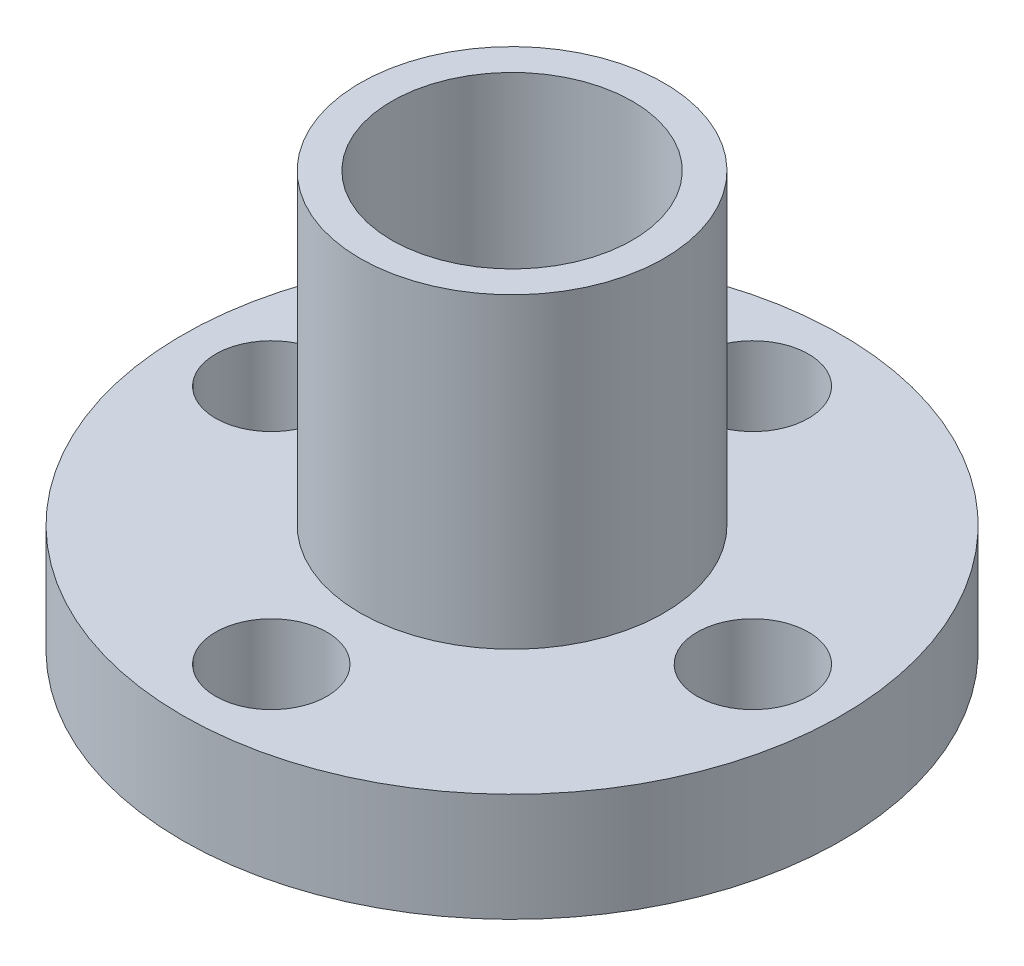
ISO-10303-21;
HEADER;
FILE_DESCRIPTION(('STEP AP214'),'2;1');
FILE_NAME('part.step','',(''),(''),'','','');
FILE_SCHEMA(('AUTOMOTIVE_DESIGN { 1 0 10303 214 1 1 1 1 }'));
ENDSEC;
DATA;
#1=APPLICATION_CONTEXT('core data for automotive mechanical design processes');
#2=APPLICATION_PROTOCOL_DEFINITION('international standard','automotive_design',2000,#1);
#3=PRODUCT_CONTEXT('',#1,'mechanical');
#4=PRODUCT('Part','Part','',(#3));
#5=PRODUCT_RELATED_PRODUCT_CATEGORY('part','',(#4));
#6=PRODUCT_DEFINITION_FORMATION('','',#4);
#7=PRODUCT_DEFINITION_CONTEXT('part definition',#1,'design');
#8=PRODUCT_DEFINITION('design','',#6,#7);
#9=PRODUCT_DEFINITION_SHAPE('','',#8);
#10=(LENGTH_UNIT() NAMED_UNIT(*) SI_UNIT(.MILLI.,.METRE.));
#11=(NAMED_UNIT(*) PLANE_ANGLE_UNIT() SI_UNIT($,.RADIAN.));
#12=(NAMED_UNIT(*) SI_UNIT($,.STERADIAN.) SOLID_ANGLE_UNIT());
#13=UNCERTAINTY_MEASURE_WITH_UNIT(LENGTH_MEASURE(1.E-05),#10,'distance_accuracy_value','');
#14=(GEOMETRIC_REPRESENTATION_CONTEXT(3) GLOBAL_UNCERTAINTY_ASSIGNED_CONTEXT((#13)) GLOBAL_UNIT_ASSIGNED_CONTEXT((#10,
#11,#12)) REPRESENTATION_CONTEXT('',''));
#15=CARTESIAN_POINT('',(0.,0.,0.));
#16=DIRECTION('',(0.,0.,1.));
#17=DIRECTION('',(1.,0.,0.));
#18=AXIS2_PLACEMENT_3D('',#15,#16,#17);
#19=CARTESIAN_POINT('',(0.,3.6,0.));
#20=DIRECTION('',(0.,-1.,0.));
#21=DIRECTION('',(0.,0.,-1.));
#22=AXIS2_PLACEMENT_3D('',#19,#20,#21);
#23=CYLINDRICAL_SURFACE('',#22,10.95);
#24=CARTESIAN_POINT('',(0.,3.6,0.));
#25=DIRECTION('',(0.,1.,0.));
#26=DIRECTION('',(0.,0.,1.));
#27=AXIS2_PLACEMENT_3D('',#24,#25,#26);
#28=CIRCLE('',#27,10.95);
#29=CARTESIAN_POINT('',(0.,3.6,10.95));
#30=VERTEX_POINT('',#29);
#31=EDGE_CURVE('E40',#30,#30,#28,.T.);
#32=ORIENTED_EDGE('',*,*,#31,.F.);
#33=EDGE_LOOP('',(#32));
#34=FACE_BOUND('',#33,.T.);
#35=CARTESIAN_POINT('',(0.,0.,0.));
#36=DIRECTION('',(0.,1.,0.));
#37=DIRECTION('',(0.,0.,1.));
#38=AXIS2_PLACEMENT_3D('',#35,#36,#37);
#39=CIRCLE('',#38,10.95);
#40=CARTESIAN_POINT('',(0.,0.,10.95));
#41=VERTEX_POINT('',#40);
#42=EDGE_CURVE('E45',#41,#41,#39,.T.);
#43=ORIENTED_EDGE('',*,*,#42,.T.);
#44=EDGE_LOOP('',(#43));
#45=FACE_BOUND('',#44,.T.);
#46=ADVANCED_FACE('F33',(#34,#45),#23,.T.);
#47=CARTESIAN_POINT('',(0.,3.6,0.));
#48=DIRECTION('',(0.,1.,0.));
#49=DIRECTION('',(0.,0.,1.));
#50=AXIS2_PLACEMENT_3D('',#47,#48,#49);
#51=PLANE('',#50);
#52=CARTESIAN_POINT('',(-7.99999999999977,3.6,2.27373675443232E-13));
#53=DIRECTION('',(0.,1.,0.));
#54=DIRECTION('',(0.,0.,1.));
#55=AXIS2_PLACEMENT_3D('',#52,#53,#54);
#56=CIRCLE('',#55,1.85000000000036);
#57=CARTESIAN_POINT('',(-7.99999999999977,3.6,1.85000000000059));
#58=VERTEX_POINT('',#57);
#59=EDGE_CURVE('E59',#58,#58,#56,.T.);
#60=ORIENTED_EDGE('',*,*,#59,.F.);
#61=EDGE_LOOP('',(#60));
#62=FACE_BOUND('',#61,.T.);
#63=CARTESIAN_POINT('',(4.52787916007828E-13,3.6,8.));
#64=DIRECTION('',(0.,1.,0.));
#65=DIRECTION('',(0.,0.,1.));
#66=AXIS2_PLACEMENT_3D('',#63,#64,#65);
#67=CIRCLE('',#66,1.85000000000049);
#68=CARTESIAN_POINT('',(4.52787916007828E-13,3.6,9.85000000000048));
#69=VERTEX_POINT('',#68);
#70=EDGE_CURVE('E56',#69,#69,#67,.T.);
#71=ORIENTED_EDGE('',*,*,#70,.F.);
#72=EDGE_LOOP('',(#71));
#73=FACE_BOUND('',#72,.T.);
#74=CARTESIAN_POINT('',(8.00000000000022,3.6,-2.26393958003914E-13));
#75=DIRECTION('',(0.,1.,0.));
#76=DIRECTION('',(0.,0.,1.));
#77=AXIS2_PLACEMENT_3D('',#74,#75,#76);
#78=CIRCLE('',#77,1.85000000000018);
#79=CARTESIAN_POINT('',(8.00000000000022,3.6,1.84999999999995));
#80=VERTEX_POINT('',#79);
#81=EDGE_CURVE('E53',#80,#80,#78,.T.);
#82=ORIENTED_EDGE('',*,*,#81,.F.);
#83=EDGE_LOOP('',(#82));
#84=FACE_BOUND('',#83,.T.);
#85=CARTESIAN_POINT('',(0.,3.6,-8.));
#86=DIRECTION('',(0.,1.,0.));
#87=DIRECTION('',(0.,0.,1.));
#88=AXIS2_PLACEMENT_3D('',#85,#86,#87);
#89=CIRCLE('',#88,1.85);
#90=CARTESIAN_POINT('',(0.,3.6,-6.15));
#91=VERTEX_POINT('',#90);
#92=EDGE_CURVE('E52',#91,#91,#89,.T.);
#93=ORIENTED_EDGE('',*,*,#92,.F.);
#94=EDGE_LOOP('',(#93));
#95=FACE_BOUND('',#94,.T.);
#96=CARTESIAN_POINT('',(0.,3.6,0.));
#97=DIRECTION('',(0.,1.,0.));
#98=DIRECTION('',(0.,0.,1.));
#99=AXIS2_PLACEMENT_3D('',#96,#97,#98);
#100=CIRCLE('',#99,5.05);
#101=CARTESIAN_POINT('',(0.,3.6,5.05));
#102=VERTEX_POINT('',#101);
#103=EDGE_CURVE('E83',#102,#102,#100,.T.);
#104=ORIENTED_EDGE('',*,*,#103,.F.);
#105=EDGE_LOOP('',(#104));
#106=FACE_BOUND('',#105,.T.);
#107=ORIENTED_EDGE('',*,*,#31,.T.);
#108=EDGE_LOOP('',(#107));
#109=FACE_BOUND('',#108,.T.);
#110=ADVANCED_FACE('F92',(#62,#73,#84,#95,#106,#109),#51,.T.);
#111=CARTESIAN_POINT('',(0.,0.,0.));
#112=DIRECTION('',(0.,1.,0.));
#113=DIRECTION('',(0.,0.,1.));
#114=AXIS2_PLACEMENT_3D('',#111,#112,#113);
#115=PLANE('',#114);
#116=CARTESIAN_POINT('',(-7.99999999999977,0.,2.27373675443232E-13));
#117=DIRECTION('',(0.,1.,0.));
#118=DIRECTION('',(0.,0.,1.));
#119=AXIS2_PLACEMENT_3D('',#116,#117,#118);
#120=CIRCLE('',#119,1.85000000000036);
#121=CARTESIAN_POINT('',(-7.99999999999977,0.,1.85000000000059));
#122=VERTEX_POINT('',#121);
#123=EDGE_CURVE('E36',#122,#122,#120,.T.);
#124=ORIENTED_EDGE('',*,*,#123,.T.);
#125=EDGE_LOOP('',(#124));
#126=FACE_BOUND('',#125,.T.);
#127=CARTESIAN_POINT('',(4.52787916007828E-13,0.,8.));
#128=DIRECTION('',(0.,1.,0.));
#129=DIRECTION('',(0.,0.,1.));
#130=AXIS2_PLACEMENT_3D('',#127,#128,#129);
#131=CIRCLE('',#130,1.85000000000049);
#132=CARTESIAN_POINT('',(4.52787916007828E-13,0.,9.85000000000048));
#133=VERTEX_POINT('',#132);
#134=EDGE_CURVE('E57',#133,#133,#131,.T.);
#135=ORIENTED_EDGE('',*,*,#134,.T.);
#136=EDGE_LOOP('',(#135));
#137=FACE_BOUND('',#136,.T.);
#138=CARTESIAN_POINT('',(8.00000000000022,0.,-2.26393958003914E-13));
#139=DIRECTION('',(0.,1.,0.));
#140=DIRECTION('',(0.,0.,1.));
#141=AXIS2_PLACEMENT_3D('',#138,#139,#140);
#142=CIRCLE('',#141,1.85000000000018);
#143=CARTESIAN_POINT('',(8.00000000000022,0.,1.84999999999995));
#144=VERTEX_POINT('',#143);
#145=EDGE_CURVE('E54',#144,#144,#142,.T.);
#146=ORIENTED_EDGE('',*,*,#145,.T.);
#147=EDGE_LOOP('',(#146));
#148=FACE_BOUND('',#147,.T.);
#149=CARTESIAN_POINT('',(0.,0.,-8.));
#150=DIRECTION('',(0.,1.,0.));
#151=DIRECTION('',(0.,0.,1.));
#152=AXIS2_PLACEMENT_3D('',#149,#150,#151);
#153=CIRCLE('',#152,1.85);
#154=CARTESIAN_POINT('',(0.,0.,-6.15));
#155=VERTEX_POINT('',#154);
#156=EDGE_CURVE('E49',#155,#155,#153,.T.);
#157=ORIENTED_EDGE('',*,*,#156,.T.);
#158=EDGE_LOOP('',(#157));
#159=FACE_BOUND('',#158,.T.);
#160=CARTESIAN_POINT('',(0.,0.,0.));
#161=DIRECTION('',(0.,1.,0.));
#162=DIRECTION('',(0.,0.,1.));
#163=AXIS2_PLACEMENT_3D('',#160,#161,#162);
#164=CIRCLE('',#163,5.05);
#165=CARTESIAN_POINT('',(0.,0.,5.05));
#166=VERTEX_POINT('',#165);
#167=EDGE_CURVE('E10',#166,#166,#164,.F.);
#168=ORIENTED_EDGE('',*,*,#167,.F.);
#169=EDGE_LOOP('',(#168));
#170=FACE_BOUND('',#169,.T.);
#171=ORIENTED_EDGE('',*,*,#42,.F.);
#172=EDGE_LOOP('',(#171));
#173=FACE_BOUND('',#172,.T.);
#174=ADVANCED_FACE('F95',(#126,#137,#148,#159,#170,#173),#115,.F.);
#175=CARTESIAN_POINT('',(0.,13.8,0.));
#176=DIRECTION('',(0.,1.,0.));
#177=DIRECTION('',(0.,0.,1.));
#178=AXIS2_PLACEMENT_3D('',#175,#176,#177);
#179=PLANE('',#178);
#180=CARTESIAN_POINT('',(0.,13.8,0.));
#181=DIRECTION('',(0.,1.,0.));
#182=DIRECTION('',(0.,0.,1.));
#183=AXIS2_PLACEMENT_3D('',#180,#181,#182);
#184=CIRCLE('',#183,5.05);
#185=CARTESIAN_POINT('',(0.,13.8,5.05));
#186=VERTEX_POINT('',#185);
#187=EDGE_CURVE('E84',#186,#186,#184,.T.);
#188=ORIENTED_EDGE('',*,*,#187,.T.);
#189=EDGE_LOOP('',(#188));
#190=FACE_BOUND('',#189,.T.);
#191=CARTESIAN_POINT('',(0.,13.8,0.));
#192=DIRECTION('',(0.,1.,0.));
#193=DIRECTION('',(0.,0.,1.));
#194=AXIS2_PLACEMENT_3D('',#191,#192,#193);
#195=CIRCLE('',#194,4.);
#196=CARTESIAN_POINT('',(0.,13.8,4.));
#197=VERTEX_POINT('',#196);
#198=EDGE_CURVE('E80',#197,#197,#195,.T.);
#199=ORIENTED_EDGE('',*,*,#198,.F.);
#200=EDGE_LOOP('',(#199));
#201=FACE_BOUND('',#200,.T.);
#202=ADVANCED_FACE('F106',(#190,#201),#179,.T.);
#203=CARTESIAN_POINT('',(0.,13.8,0.));
#204=DIRECTION('',(0.,-1.,0.));
#205=DIRECTION('',(0.,0.,-1.));
#206=AXIS2_PLACEMENT_3D('',#203,#204,#205);
#207=CYLINDRICAL_SURFACE('',#206,5.05);
#208=ORIENTED_EDGE('',*,*,#187,.F.);
#209=EDGE_LOOP('',(#208));
#210=FACE_BOUND('',#209,.T.);
#211=ORIENTED_EDGE('',*,*,#103,.T.);
#212=EDGE_LOOP('',(#211));
#213=FACE_BOUND('',#212,.T.);
#214=ADVANCED_FACE('F90',(#210,#213),#207,.T.);
#215=CARTESIAN_POINT('',(0.,13.8,0.));
#216=DIRECTION('',(0.,-1.,0.));
#217=DIRECTION('',(0.,0.,-1.));
#218=AXIS2_PLACEMENT_3D('',#215,#216,#217);
#219=CYLINDRICAL_SURFACE('',#218,4.);
#220=ORIENTED_EDGE('',*,*,#198,.T.);
#221=EDGE_LOOP('',(#220));
#222=FACE_BOUND('',#221,.T.);
#223=CARTESIAN_POINT('',(0.,-0.65,0.));
#224=DIRECTION('',(0.,-1.,0.));
#225=DIRECTION('',(0.,0.,-1.));
#226=AXIS2_PLACEMENT_3D('',#223,#224,#225);
#227=CIRCLE('',#226,4.);
#228=CARTESIAN_POINT('',(0.,-0.65,-4.));
#229=VERTEX_POINT('',#228);
#230=EDGE_CURVE('E74',#229,#229,#227,.T.);
#231=ORIENTED_EDGE('',*,*,#230,.T.);
#232=EDGE_LOOP('',(#231));
#233=FACE_BOUND('',#232,.T.);
#234=ADVANCED_FACE('F115',(#222,#233),#219,.F.);
#235=CARTESIAN_POINT('',(0.,-0.65,0.));
#236=DIRECTION('',(0.,-1.,0.));
#237=DIRECTION('',(0.,0.,-1.));
#238=AXIS2_PLACEMENT_3D('',#235,#236,#237);
#239=PLANE('',#238);
#240=CARTESIAN_POINT('',(0.,-0.65,0.));
#241=DIRECTION('',(0.,-1.,0.));
#242=DIRECTION('',(0.,0.,-1.));
#243=AXIS2_PLACEMENT_3D('',#240,#241,#242);
#244=CIRCLE('',#243,5.05);
#245=CARTESIAN_POINT('',(0.,-0.65,-5.05));
#246=VERTEX_POINT('',#245);
#247=EDGE_CURVE('E77',#246,#246,#244,.T.);
#248=ORIENTED_EDGE('',*,*,#247,.T.);
#249=EDGE_LOOP('',(#248));
#250=FACE_BOUND('',#249,.T.);
#251=ORIENTED_EDGE('',*,*,#230,.F.);
#252=EDGE_LOOP('',(#251));
#253=FACE_BOUND('',#252,.T.);
#254=ADVANCED_FACE('F120',(#250,#253),#239,.T.);
#255=CARTESIAN_POINT('',(0.,-0.65,0.));
#256=DIRECTION('',(0.,1.,0.));
#257=DIRECTION('',(0.,0.,1.));
#258=AXIS2_PLACEMENT_3D('',#255,#256,#257);
#259=CYLINDRICAL_SURFACE('',#258,5.05);
#260=ORIENTED_EDGE('',*,*,#247,.F.);
#261=EDGE_LOOP('',(#260));
#262=FACE_BOUND('',#261,.T.);
#263=ORIENTED_EDGE('',*,*,#167,.T.);
#264=EDGE_LOOP('',(#263));
#265=FACE_BOUND('',#264,.T.);
#266=ADVANCED_FACE('F122',(#262,#265),#259,.T.);
#267=CARTESIAN_POINT('',(0.,-0.65,-8.));
#268=DIRECTION('',(0.,1.,0.));
#269=DIRECTION('',(0.,0.,1.));
#270=AXIS2_PLACEMENT_3D('',#267,#268,#269);
#271=CYLINDRICAL_SURFACE('',#270,1.85);
#272=ORIENTED_EDGE('',*,*,#92,.T.);
#273=EDGE_LOOP('',(#272));
#274=FACE_BOUND('',#273,.T.);
#275=ORIENTED_EDGE('',*,*,#156,.F.);
#276=EDGE_LOOP('',(#275));
#277=FACE_BOUND('',#276,.T.);
#278=ADVANCED_FACE('F125',(#274,#277),#271,.F.);
#279=CARTESIAN_POINT('',(8.00000000000022,-0.65,-2.26393958003914E-13));
#280=DIRECTION('',(0.,1.,0.));
#281=DIRECTION('',(0.,0.,1.));
#282=AXIS2_PLACEMENT_3D('',#279,#280,#281);
#283=CYLINDRICAL_SURFACE('',#282,1.85000000000018);
#284=ORIENTED_EDGE('',*,*,#81,.T.);
#285=EDGE_LOOP('',(#284));
#286=FACE_BOUND('',#285,.T.);
#287=ORIENTED_EDGE('',*,*,#145,.F.);
#288=EDGE_LOOP('',(#287));
#289=FACE_BOUND('',#288,.T.);
#290=ADVANCED_FACE('F132',(#286,#289),#283,.F.);
#291=CARTESIAN_POINT('',(4.52787916007828E-13,-0.65,8.));
#292=DIRECTION('',(0.,1.,0.));
#293=DIRECTION('',(0.,0.,1.));
#294=AXIS2_PLACEMENT_3D('',#291,#292,#293);
#295=CYLINDRICAL_SURFACE('',#294,1.85000000000049);
#296=ORIENTED_EDGE('',*,*,#70,.T.);
#297=EDGE_LOOP('',(#296));
#298=FACE_BOUND('',#297,.T.);
#299=ORIENTED_EDGE('',*,*,#134,.F.);
#300=EDGE_LOOP('',(#299));
#301=FACE_BOUND('',#300,.T.);
#302=ADVANCED_FACE('F136',(#298,#301),#295,.F.);
#303=CARTESIAN_POINT('',(-7.99999999999977,-0.65,2.27373675443232E-13));
#304=DIRECTION('',(0.,1.,0.));
#305=DIRECTION('',(0.,0.,1.));
#306=AXIS2_PLACEMENT_3D('',#303,#304,#305);
#307=CYLINDRICAL_SURFACE('',#306,1.85000000000036);
#308=ORIENTED_EDGE('',*,*,#59,.T.);
#309=EDGE_LOOP('',(#308));
#310=FACE_BOUND('',#309,.T.);
#311=ORIENTED_EDGE('',*,*,#123,.F.);
#312=EDGE_LOOP('',(#311));
#313=FACE_BOUND('',#312,.T.);
#314=ADVANCED_FACE('F140',(#310,#313),#307,.F.);
#315=CLOSED_SHELL('',(#46,#110,#174,#202,#214,#234,#254,#266,#278,#290,#302,#314));
#316=MANIFOLD_SOLID_BREP('B2',#315);
#317=ADVANCED_BREP_SHAPE_REPRESENTATION('',(#18,#316),#14);
#318=SHAPE_DEFINITION_REPRESENTATION(#9,#317);
ENDSEC;
END-ISO-10303-21;
